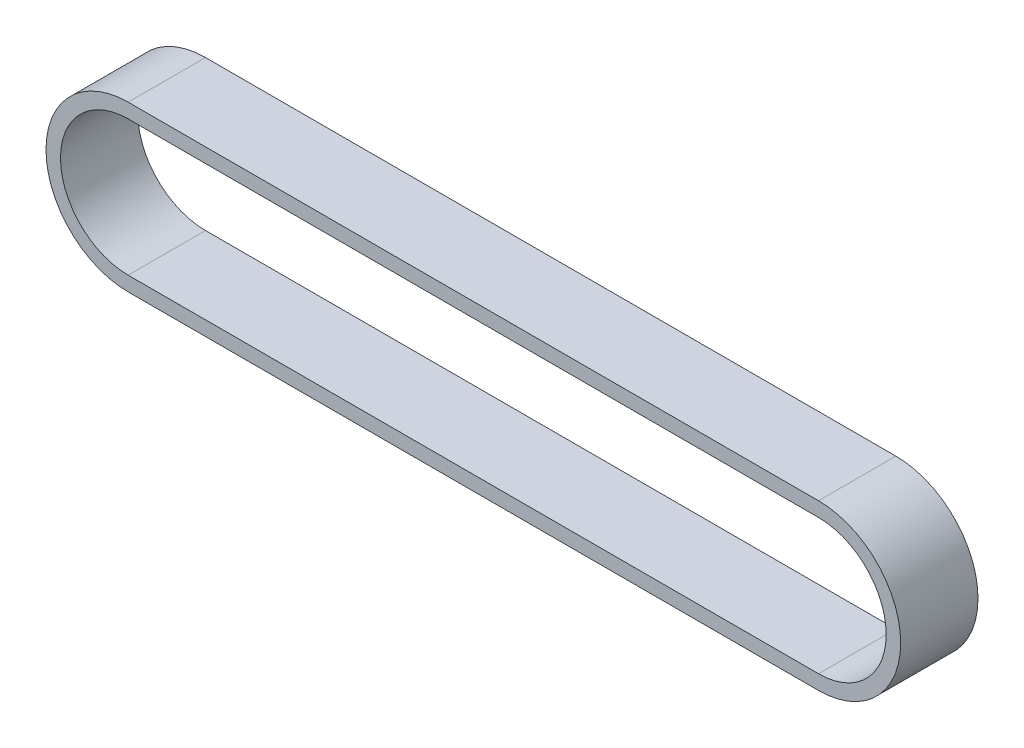
ISO-10303-21;
HEADER;
FILE_DESCRIPTION(('STEP AP214'),'2;1');
FILE_NAME('part.step','',(''),(''),'','','');
FILE_SCHEMA(('AUTOMOTIVE_DESIGN { 1 0 10303 214 1 1 1 1 }'));
ENDSEC;
DATA;
#1=APPLICATION_CONTEXT('core data for automotive mechanical design processes');
#2=APPLICATION_PROTOCOL_DEFINITION('international standard','automotive_design',2000,#1);
#3=PRODUCT_CONTEXT('',#1,'mechanical');
#4=PRODUCT('Part','Part','',(#3));
#5=PRODUCT_RELATED_PRODUCT_CATEGORY('part','',(#4));
#6=PRODUCT_DEFINITION_FORMATION('','',#4);
#7=PRODUCT_DEFINITION_CONTEXT('part definition',#1,'design');
#8=PRODUCT_DEFINITION('design','',#6,#7);
#9=PRODUCT_DEFINITION_SHAPE('','',#8);
#10=(LENGTH_UNIT() NAMED_UNIT(*) SI_UNIT(.MILLI.,.METRE.));
#11=(NAMED_UNIT(*) PLANE_ANGLE_UNIT() SI_UNIT($,.RADIAN.));
#12=(NAMED_UNIT(*) SI_UNIT($,.STERADIAN.) SOLID_ANGLE_UNIT());
#13=UNCERTAINTY_MEASURE_WITH_UNIT(LENGTH_MEASURE(1.E-05),#10,'distance_accuracy_value','');
#14=(GEOMETRIC_REPRESENTATION_CONTEXT(3) GLOBAL_UNCERTAINTY_ASSIGNED_CONTEXT((#13)) GLOBAL_UNIT_ASSIGNED_CONTEXT((#10,
#11,#12)) REPRESENTATION_CONTEXT('',''));
#15=CARTESIAN_POINT('',(0.,0.,0.));
#16=DIRECTION('',(0.,0.,1.));
#17=DIRECTION('',(1.,0.,0.));
#18=AXIS2_PLACEMENT_3D('',#15,#16,#17);
#19=CARTESIAN_POINT('',(0.,0.,6.4));
#20=DIRECTION('',(0.,0.,1.));
#21=DIRECTION('',(1.,0.,0.));
#22=AXIS2_PLACEMENT_3D('',#19,#20,#21);
#23=PLANE('',#22);
#24=CARTESIAN_POINT('',(0.,0.,6.4));
#25=DIRECTION('',(0.,0.,1.));
#26=DIRECTION('',(1.,0.,0.));
#27=AXIS2_PLACEMENT_3D('',#24,#25,#26);
#28=CIRCLE('',#27,6.79999999999998);
#29=CARTESIAN_POINT('',(0.,-6.79999999999999,6.4));
#30=VERTEX_POINT('',#29);
#31=CARTESIAN_POINT('',(0.,6.79999999999997,6.4));
#32=VERTEX_POINT('',#31);
#33=EDGE_CURVE('E156',#30,#32,#28,.T.);
#34=ORIENTED_EDGE('',*,*,#33,.T.);
#35=DIRECTION('',(-1.,0.,0.));
#36=VECTOR('',#35,1.);
#37=CARTESIAN_POINT('',(0.,6.79999999999997,6.4));
#38=LINE('',#37,#36);
#39=CARTESIAN_POINT('',(-57.1401785087881,6.79999999999996,6.4));
#40=VERTEX_POINT('',#39);
#41=EDGE_CURVE('E159',#32,#40,#38,.T.);
#42=ORIENTED_EDGE('',*,*,#41,.T.);
#43=CARTESIAN_POINT('',(-57.1401785087881,0.,6.4));
#44=DIRECTION('',(0.,0.,1.));
#45=DIRECTION('',(1.,0.,0.));
#46=AXIS2_PLACEMENT_3D('',#43,#44,#45);
#47=CIRCLE('',#46,6.79999999999998);
#48=CARTESIAN_POINT('',(-57.1401785087881,-6.79999999999998,6.4));
#49=VERTEX_POINT('',#48);
#50=EDGE_CURVE('E162',#40,#49,#47,.T.);
#51=ORIENTED_EDGE('',*,*,#50,.T.);
#52=DIRECTION('',(-1.,0.,0.));
#53=VECTOR('',#52,1.);
#54=CARTESIAN_POINT('',(0.,-6.79999999999999,6.4));
#55=LINE('',#54,#53);
#56=EDGE_CURVE('E164',#30,#49,#55,.T.);
#57=ORIENTED_EDGE('',*,*,#56,.F.);
#58=EDGE_LOOP('',(#34,#42,#51,#57));
#59=FACE_BOUND('',#58,.T.);
#60=DIRECTION('',(-1.,0.,0.));
#61=VECTOR('',#60,1.);
#62=CARTESIAN_POINT('',(0.,5.59999999999997,6.4));
#63=LINE('',#62,#61);
#64=CARTESIAN_POINT('',(0.,5.59999999999997,6.4));
#65=VERTEX_POINT('',#64);
#66=CARTESIAN_POINT('',(-57.1401785087881,5.59999999999996,6.4));
#67=VERTEX_POINT('',#66);
#68=EDGE_CURVE('E129',#65,#67,#63,.T.);
#69=ORIENTED_EDGE('',*,*,#68,.F.);
#70=CARTESIAN_POINT('',(0.,0.,6.4));
#71=DIRECTION('',(0.,0.,1.));
#72=DIRECTION('',(1.,0.,0.));
#73=AXIS2_PLACEMENT_3D('',#70,#71,#72);
#74=CIRCLE('',#73,5.59999999999998);
#75=CARTESIAN_POINT('',(0.,-5.59999999999999,6.4));
#76=VERTEX_POINT('',#75);
#77=EDGE_CURVE('E121',#76,#65,#74,.T.);
#78=ORIENTED_EDGE('',*,*,#77,.F.);
#79=DIRECTION('',(-1.,0.,0.));
#80=VECTOR('',#79,1.);
#81=CARTESIAN_POINT('',(0.,-5.59999999999999,6.4));
#82=LINE('',#81,#80);
#83=CARTESIAN_POINT('',(-57.1401785087881,-5.6,6.4));
#84=VERTEX_POINT('',#83);
#85=EDGE_CURVE('E143',#76,#84,#82,.T.);
#86=ORIENTED_EDGE('',*,*,#85,.T.);
#87=CARTESIAN_POINT('',(-57.1401785087881,0.,6.4));
#88=DIRECTION('',(0.,0.,1.));
#89=DIRECTION('',(1.,0.,0.));
#90=AXIS2_PLACEMENT_3D('',#87,#88,#89);
#91=CIRCLE('',#90,5.59999999999998);
#92=EDGE_CURVE('E141',#67,#84,#91,.T.);
#93=ORIENTED_EDGE('',*,*,#92,.F.);
#94=EDGE_LOOP('',(#69,#78,#86,#93));
#95=FACE_BOUND('',#94,.T.);
#96=ADVANCED_FACE('F56',(#59,#95),#23,.T.);
#97=CARTESIAN_POINT('',(0.,0.,0.));
#98=DIRECTION('',(0.,0.,1.));
#99=DIRECTION('',(1.,0.,0.));
#100=AXIS2_PLACEMENT_3D('',#97,#98,#99);
#101=PLANE('',#100);
#102=CARTESIAN_POINT('',(0.,0.,0.));
#103=DIRECTION('',(0.,0.,1.));
#104=DIRECTION('',(1.,0.,0.));
#105=AXIS2_PLACEMENT_3D('',#102,#103,#104);
#106=CIRCLE('',#105,6.79999999999998);
#107=CARTESIAN_POINT('',(0.,-6.79999999999999,0.));
#108=VERTEX_POINT('',#107);
#109=CARTESIAN_POINT('',(0.,6.79999999999997,0.));
#110=VERTEX_POINT('',#109);
#111=EDGE_CURVE('E137',#108,#110,#106,.T.);
#112=ORIENTED_EDGE('',*,*,#111,.F.);
#113=DIRECTION('',(-1.,0.,0.));
#114=VECTOR('',#113,1.);
#115=CARTESIAN_POINT('',(0.,-6.79999999999999,0.));
#116=LINE('',#115,#114);
#117=CARTESIAN_POINT('',(-57.1401785087881,-6.79999999999998,0.));
#118=VERTEX_POINT('',#117);
#119=EDGE_CURVE('E160',#108,#118,#116,.T.);
#120=ORIENTED_EDGE('',*,*,#119,.T.);
#121=CARTESIAN_POINT('',(-57.1401785087881,0.,0.));
#122=DIRECTION('',(0.,0.,1.));
#123=DIRECTION('',(1.,0.,0.));
#124=AXIS2_PLACEMENT_3D('',#121,#122,#123);
#125=CIRCLE('',#124,6.79999999999998);
#126=CARTESIAN_POINT('',(-57.1401785087881,6.79999999999996,0.));
#127=VERTEX_POINT('',#126);
#128=EDGE_CURVE('E172',#127,#118,#125,.T.);
#129=ORIENTED_EDGE('',*,*,#128,.F.);
#130=DIRECTION('',(-1.,0.,0.));
#131=VECTOR('',#130,1.);
#132=CARTESIAN_POINT('',(0.,6.79999999999997,0.));
#133=LINE('',#132,#131);
#134=EDGE_CURVE('E170',#110,#127,#133,.T.);
#135=ORIENTED_EDGE('',*,*,#134,.F.);
#136=EDGE_LOOP('',(#112,#120,#129,#135));
#137=FACE_BOUND('',#136,.T.);
#138=CARTESIAN_POINT('',(0.,0.,0.));
#139=DIRECTION('',(0.,0.,1.));
#140=DIRECTION('',(1.,0.,0.));
#141=AXIS2_PLACEMENT_3D('',#138,#139,#140);
#142=CIRCLE('',#141,5.59999999999998);
#143=CARTESIAN_POINT('',(0.,-5.59999999999999,0.));
#144=VERTEX_POINT('',#143);
#145=CARTESIAN_POINT('',(0.,5.59999999999997,0.));
#146=VERTEX_POINT('',#145);
#147=EDGE_CURVE('E79',#144,#146,#142,.T.);
#148=ORIENTED_EDGE('',*,*,#147,.T.);
#149=DIRECTION('',(-1.,0.,0.));
#150=VECTOR('',#149,1.);
#151=CARTESIAN_POINT('',(0.,5.59999999999997,0.));
#152=LINE('',#151,#150);
#153=CARTESIAN_POINT('',(-57.1401785087881,5.59999999999996,0.));
#154=VERTEX_POINT('',#153);
#155=EDGE_CURVE('E136',#146,#154,#152,.T.);
#156=ORIENTED_EDGE('',*,*,#155,.T.);
#157=CARTESIAN_POINT('',(-57.1401785087881,0.,0.));
#158=DIRECTION('',(0.,0.,1.));
#159=DIRECTION('',(1.,0.,0.));
#160=AXIS2_PLACEMENT_3D('',#157,#158,#159);
#161=CIRCLE('',#160,5.59999999999998);
#162=CARTESIAN_POINT('',(-57.1401785087881,-5.59999999999998,0.));
#163=VERTEX_POINT('',#162);
#164=EDGE_CURVE('E149',#154,#163,#161,.T.);
#165=ORIENTED_EDGE('',*,*,#164,.T.);
#166=DIRECTION('',(-1.,0.,0.));
#167=VECTOR('',#166,1.);
#168=CARTESIAN_POINT('',(0.,-5.59999999999999,0.));
#169=LINE('',#168,#167);
#170=EDGE_CURVE('E130',#144,#163,#169,.T.);
#171=ORIENTED_EDGE('',*,*,#170,.F.);
#172=EDGE_LOOP('',(#148,#156,#165,#171));
#173=FACE_BOUND('',#172,.T.);
#174=ADVANCED_FACE('F189',(#137,#173),#101,.F.);
#175=CARTESIAN_POINT('',(0.,0.,6.4));
#176=DIRECTION('',(0.,0.,-1.));
#177=DIRECTION('',(-1.,0.,0.));
#178=AXIS2_PLACEMENT_3D('',#175,#176,#177);
#179=CYLINDRICAL_SURFACE('',#178,6.79999999999998);
#180=ORIENTED_EDGE('',*,*,#111,.T.);
#181=DIRECTION('',(0.,0.,-1.));
#182=VECTOR('',#181,1.);
#183=CARTESIAN_POINT('',(0.,6.79999999999997,6.4));
#184=LINE('',#183,#182);
#185=EDGE_CURVE('E12',#32,#110,#184,.T.);
#186=ORIENTED_EDGE('',*,*,#185,.F.);
#187=ORIENTED_EDGE('',*,*,#33,.F.);
#188=DIRECTION('',(0.,0.,-1.));
#189=VECTOR('',#188,1.);
#190=CARTESIAN_POINT('',(0.,-6.79999999999999,6.4));
#191=LINE('',#190,#189);
#192=EDGE_CURVE('E167',#30,#108,#191,.T.);
#193=ORIENTED_EDGE('',*,*,#192,.T.);
#194=EDGE_LOOP('',(#180,#186,#187,#193));
#195=FACE_BOUND('',#194,.T.);
#196=ADVANCED_FACE('F58',(#195),#179,.T.);
#197=CARTESIAN_POINT('',(0.,6.79999999999997,6.4));
#198=DIRECTION('',(0.,-1.,0.));
#199=DIRECTION('',(1.,0.,0.));
#200=AXIS2_PLACEMENT_3D('',#197,#198,#199);
#201=PLANE('',#200);
#202=ORIENTED_EDGE('',*,*,#134,.T.);
#203=DIRECTION('',(0.,0.,-1.));
#204=VECTOR('',#203,1.);
#205=CARTESIAN_POINT('',(-57.1401785087881,6.79999999999996,6.4));
#206=LINE('',#205,#204);
#207=EDGE_CURVE('E64',#40,#127,#206,.T.);
#208=ORIENTED_EDGE('',*,*,#207,.F.);
#209=ORIENTED_EDGE('',*,*,#41,.F.);
#210=ORIENTED_EDGE('',*,*,#185,.T.);
#211=EDGE_LOOP('',(#202,#208,#209,#210));
#212=FACE_BOUND('',#211,.T.);
#213=ADVANCED_FACE('F198',(#212),#201,.F.);
#214=CARTESIAN_POINT('',(-57.1401785087881,0.,6.4));
#215=DIRECTION('',(0.,0.,-1.));
#216=DIRECTION('',(-1.,0.,0.));
#217=AXIS2_PLACEMENT_3D('',#214,#215,#216);
#218=CYLINDRICAL_SURFACE('',#217,6.79999999999998);
#219=ORIENTED_EDGE('',*,*,#128,.T.);
#220=DIRECTION('',(0.,0.,-1.));
#221=VECTOR('',#220,1.);
#222=CARTESIAN_POINT('',(-57.1401785087881,-6.79999999999998,6.4));
#223=LINE('',#222,#221);
#224=EDGE_CURVE('E178',#49,#118,#223,.T.);
#225=ORIENTED_EDGE('',*,*,#224,.F.);
#226=ORIENTED_EDGE('',*,*,#50,.F.);
#227=ORIENTED_EDGE('',*,*,#207,.T.);
#228=EDGE_LOOP('',(#219,#225,#226,#227));
#229=FACE_BOUND('',#228,.T.);
#230=ADVANCED_FACE('F184',(#229),#218,.T.);
#231=CARTESIAN_POINT('',(0.,-6.79999999999999,6.4));
#232=DIRECTION('',(0.,-1.,0.));
#233=DIRECTION('',(1.,0.,0.));
#234=AXIS2_PLACEMENT_3D('',#231,#232,#233);
#235=PLANE('',#234);
#236=ORIENTED_EDGE('',*,*,#119,.F.);
#237=ORIENTED_EDGE('',*,*,#192,.F.);
#238=ORIENTED_EDGE('',*,*,#56,.T.);
#239=ORIENTED_EDGE('',*,*,#224,.T.);
#240=EDGE_LOOP('',(#236,#237,#238,#239));
#241=FACE_BOUND('',#240,.T.);
#242=ADVANCED_FACE('F193',(#241),#235,.T.);
#243=CARTESIAN_POINT('',(0.,0.,6.4));
#244=DIRECTION('',(0.,0.,-1.));
#245=DIRECTION('',(-1.,0.,0.));
#246=AXIS2_PLACEMENT_3D('',#243,#244,#245);
#247=CYLINDRICAL_SURFACE('',#246,5.59999999999998);
#248=ORIENTED_EDGE('',*,*,#147,.F.);
#249=DIRECTION('',(0.,0.,-1.));
#250=VECTOR('',#249,1.);
#251=CARTESIAN_POINT('',(0.,-5.59999999999999,6.4));
#252=LINE('',#251,#250);
#253=EDGE_CURVE('E125',#76,#144,#252,.T.);
#254=ORIENTED_EDGE('',*,*,#253,.F.);
#255=ORIENTED_EDGE('',*,*,#77,.T.);
#256=DIRECTION('',(0.,0.,-1.));
#257=VECTOR('',#256,1.);
#258=CARTESIAN_POINT('',(0.,5.59999999999997,6.4));
#259=LINE('',#258,#257);
#260=EDGE_CURVE('E124',#65,#146,#259,.T.);
#261=ORIENTED_EDGE('',*,*,#260,.T.);
#262=EDGE_LOOP('',(#248,#254,#255,#261));
#263=FACE_BOUND('',#262,.T.);
#264=ADVANCED_FACE('F123',(#263),#247,.F.);
#265=CARTESIAN_POINT('',(0.,5.59999999999997,6.4));
#266=DIRECTION('',(0.,-1.,0.));
#267=DIRECTION('',(1.,0.,0.));
#268=AXIS2_PLACEMENT_3D('',#265,#266,#267);
#269=PLANE('',#268);
#270=ORIENTED_EDGE('',*,*,#155,.F.);
#271=ORIENTED_EDGE('',*,*,#260,.F.);
#272=ORIENTED_EDGE('',*,*,#68,.T.);
#273=DIRECTION('',(0.,0.,-1.));
#274=VECTOR('',#273,1.);
#275=CARTESIAN_POINT('',(-57.1401785087881,5.59999999999996,6.4));
#276=LINE('',#275,#274);
#277=EDGE_CURVE('E138',#67,#154,#276,.T.);
#278=ORIENTED_EDGE('',*,*,#277,.T.);
#279=EDGE_LOOP('',(#270,#271,#272,#278));
#280=FACE_BOUND('',#279,.T.);
#281=ADVANCED_FACE('F133',(#280),#269,.T.);
#282=CARTESIAN_POINT('',(-57.1401785087881,0.,6.4));
#283=DIRECTION('',(0.,0.,-1.));
#284=DIRECTION('',(-1.,0.,0.));
#285=AXIS2_PLACEMENT_3D('',#282,#283,#284);
#286=CYLINDRICAL_SURFACE('',#285,5.59999999999998);
#287=ORIENTED_EDGE('',*,*,#164,.F.);
#288=ORIENTED_EDGE('',*,*,#277,.F.);
#289=ORIENTED_EDGE('',*,*,#92,.T.);
#290=DIRECTION('',(0.,0.,-1.));
#291=VECTOR('',#290,1.);
#292=CARTESIAN_POINT('',(-57.1401785087881,-5.59999999999998,6.4));
#293=LINE('',#292,#291);
#294=EDGE_CURVE('E71',#84,#163,#293,.T.);
#295=ORIENTED_EDGE('',*,*,#294,.T.);
#296=EDGE_LOOP('',(#287,#288,#289,#295));
#297=FACE_BOUND('',#296,.T.);
#298=ADVANCED_FACE('F235',(#297),#286,.F.);
#299=CARTESIAN_POINT('',(0.,-5.59999999999999,6.4));
#300=DIRECTION('',(0.,-1.,0.));
#301=DIRECTION('',(1.,0.,0.));
#302=AXIS2_PLACEMENT_3D('',#299,#300,#301);
#303=PLANE('',#302);
#304=ORIENTED_EDGE('',*,*,#170,.T.);
#305=ORIENTED_EDGE('',*,*,#294,.F.);
#306=ORIENTED_EDGE('',*,*,#85,.F.);
#307=ORIENTED_EDGE('',*,*,#253,.T.);
#308=EDGE_LOOP('',(#304,#305,#306,#307));
#309=FACE_BOUND('',#308,.T.);
#310=ADVANCED_FACE('F241',(#309),#303,.F.);
#311=CLOSED_SHELL('',(#96,#174,#196,#213,#230,#242,#264,#281,#298,#310));
#312=MANIFOLD_SOLID_BREP('B2',#311);
#313=ADVANCED_BREP_SHAPE_REPRESENTATION('',(#18,#312),#14);
#314=SHAPE_DEFINITION_REPRESENTATION(#9,#313);
ENDSEC;
END-ISO-10303-21;
